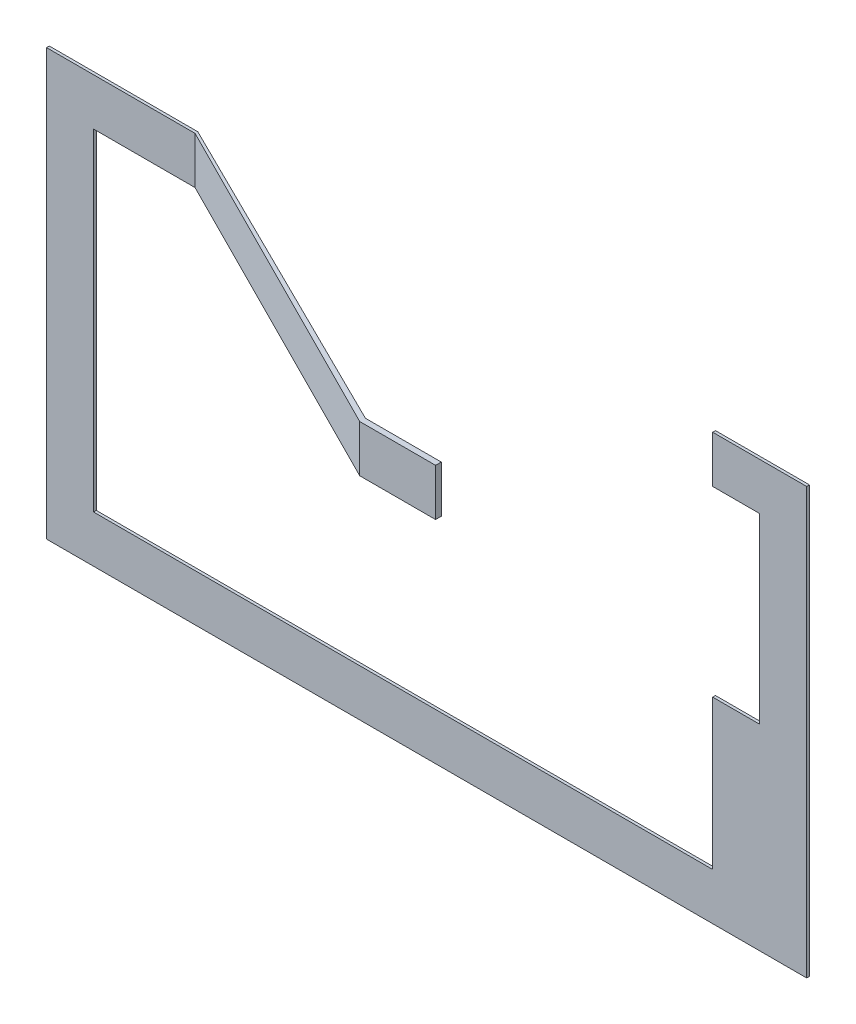
ISO-10303-21;
HEADER;
FILE_DESCRIPTION(('STEP AP214'),'2;1');
FILE_NAME('part.step','',(''),(''),'','','');
FILE_SCHEMA(('AUTOMOTIVE_DESIGN { 1 0 10303 214 1 1 1 1 }'));
ENDSEC;
DATA;
#1=APPLICATION_CONTEXT('core data for automotive mechanical design processes');
#2=APPLICATION_PROTOCOL_DEFINITION('international standard','automotive_design',2000,#1);
#3=PRODUCT_CONTEXT('',#1,'mechanical');
#4=PRODUCT('Part','Part','',(#3));
#5=PRODUCT_RELATED_PRODUCT_CATEGORY('part','',(#4));
#6=PRODUCT_DEFINITION_FORMATION('','',#4);
#7=PRODUCT_DEFINITION_CONTEXT('part definition',#1,'design');
#8=PRODUCT_DEFINITION('design','',#6,#7);
#9=PRODUCT_DEFINITION_SHAPE('','',#8);
#10=(LENGTH_UNIT() NAMED_UNIT(*) SI_UNIT(.MILLI.,.METRE.));
#11=(NAMED_UNIT(*) PLANE_ANGLE_UNIT() SI_UNIT($,.RADIAN.));
#12=(NAMED_UNIT(*) SI_UNIT($,.STERADIAN.) SOLID_ANGLE_UNIT());
#13=UNCERTAINTY_MEASURE_WITH_UNIT(LENGTH_MEASURE(1.E-05),#10,'distance_accuracy_value','');
#14=(GEOMETRIC_REPRESENTATION_CONTEXT(3) GLOBAL_UNCERTAINTY_ASSIGNED_CONTEXT((#13)) GLOBAL_UNIT_ASSIGNED_CONTEXT((#10,
#11,#12)) REPRESENTATION_CONTEXT('',''));
#15=CARTESIAN_POINT('',(0.,0.,0.));
#16=DIRECTION('',(0.,0.,1.));
#17=DIRECTION('',(1.,0.,0.));
#18=AXIS2_PLACEMENT_3D('',#15,#16,#17);
#19=CARTESIAN_POINT('',(-11900.,6700.,-50.0000000000007));
#20=DIRECTION('',(0.,1.,0.));
#21=DIRECTION('',(0.,0.,1.));
#22=AXIS2_PLACEMENT_3D('',#19,#20,#21);
#23=PLANE('',#22);
#24=DIRECTION('',(-1.,0.,0.));
#25=VECTOR('',#24,1.);
#26=CARTESIAN_POINT('',(-11900.,6700.,0.));
#27=LINE('',#26,#25);
#28=CARTESIAN_POINT('',(-9214.46398244719,6700.,0.));
#29=VERTEX_POINT('',#28);
#30=CARTESIAN_POINT('',(-11900.,6700.,0.));
#31=VERTEX_POINT('',#30);
#32=EDGE_CURVE('E170',#29,#31,#27,.T.);
#33=ORIENTED_EDGE('',*,*,#32,.F.);
#34=DIRECTION('',(0.893064348478756,0.,0.449928960477335));
#35=VECTOR('',#34,1.);
#36=CARTESIAN_POINT('',(-9214.46398244719,6700.,0.));
#37=LINE('',#36,#35);
#38=CARTESIAN_POINT('',(-3210.13909684267,6700.,3025.));
#39=VERTEX_POINT('',#38);
#40=EDGE_CURVE('E96',#29,#39,#37,.T.);
#41=ORIENTED_EDGE('',*,*,#40,.T.);
#42=DIRECTION('',(1.,0.,0.));
#43=VECTOR('',#42,1.);
#44=CARTESIAN_POINT('',(-3210.13909684267,6700.,3025.));
#45=LINE('',#44,#43);
#46=CARTESIAN_POINT('',(-1837.69853217535,6700.,3025.));
#47=VERTEX_POINT('',#46);
#48=EDGE_CURVE('E261',#39,#47,#45,.T.);
#49=ORIENTED_EDGE('',*,*,#48,.T.);
#50=DIRECTION('',(0.,0.,-1.));
#51=VECTOR('',#50,1.);
#52=CARTESIAN_POINT('',(-1837.69853217535,6700.,3025.));
#53=LINE('',#52,#51);
#54=CARTESIAN_POINT('',(-1837.69853217535,6700.,2922.06183685759));
#55=VERTEX_POINT('',#54);
#56=EDGE_CURVE('E264',#47,#55,#53,.T.);
#57=ORIENTED_EDGE('',*,*,#56,.T.);
#58=DIRECTION('',(-1.,0.,0.));
#59=VECTOR('',#58,1.);
#60=CARTESIAN_POINT('',(-1837.69853217535,6700.,2922.06183685759));
#61=LINE('',#60,#59);
#62=CARTESIAN_POINT('',(-3210.13909684267,6700.,2922.06183685759));
#63=VERTEX_POINT('',#62);
#64=EDGE_CURVE('E248',#55,#63,#61,.T.);
#65=ORIENTED_EDGE('',*,*,#64,.T.);
#66=DIRECTION('',(-0.896217118847052,0.,-0.443615684895708));
#67=VECTOR('',#66,1.);
#68=CARTESIAN_POINT('',(-3210.13909684267,6700.,2922.06183685759));
#69=LINE('',#68,#67);
#70=CARTESIAN_POINT('',(-9214.46398244719,6700.,-50.0000000000007));
#71=VERTEX_POINT('',#70);
#72=EDGE_CURVE('E244',#63,#71,#69,.T.);
#73=ORIENTED_EDGE('',*,*,#72,.T.);
#74=DIRECTION('',(-1.,0.,0.));
#75=VECTOR('',#74,1.);
#76=CARTESIAN_POINT('',(-11900.,6700.,-50.0000000000007));
#77=LINE('',#76,#75);
#78=CARTESIAN_POINT('',(-11900.,6700.,-50.0000000000007));
#79=VERTEX_POINT('',#78);
#80=EDGE_CURVE('E209',#71,#79,#77,.T.);
#81=ORIENTED_EDGE('',*,*,#80,.T.);
#82=DIRECTION('',(0.,0.,1.));
#83=VECTOR('',#82,1.);
#84=CARTESIAN_POINT('',(-11900.,6700.,-50.0000000000007));
#85=LINE('',#84,#83);
#86=EDGE_CURVE('E33',#79,#31,#85,.T.);
#87=ORIENTED_EDGE('',*,*,#86,.T.);
#88=EDGE_LOOP('',(#33,#41,#49,#57,#65,#73,#81,#87));
#89=FACE_BOUND('',#88,.T.);
#90=ADVANCED_FACE('F30',(#89),#23,.T.);
#91=CARTESIAN_POINT('',(-9214.46398244719,5850.,-50.0000000000007));
#92=DIRECTION('',(0.,-1.,0.));
#93=DIRECTION('',(0.,0.,-1.));
#94=AXIS2_PLACEMENT_3D('',#91,#92,#93);
#95=PLANE('',#94);
#96=DIRECTION('',(1.,0.,0.));
#97=VECTOR('',#96,1.);
#98=CARTESIAN_POINT('',(-9214.46398244719,5850.,0.));
#99=LINE('',#98,#97);
#100=CARTESIAN_POINT('',(-11050.,5850.,0.));
#101=VERTEX_POINT('',#100);
#102=CARTESIAN_POINT('',(-9214.46398244719,5850.,0.));
#103=VERTEX_POINT('',#102);
#104=EDGE_CURVE('E204',#101,#103,#99,.T.);
#105=ORIENTED_EDGE('',*,*,#104,.F.);
#106=DIRECTION('',(0.,0.,1.));
#107=VECTOR('',#106,1.);
#108=CARTESIAN_POINT('',(-11050.,5850.,-50.0000000000007));
#109=LINE('',#108,#107);
#110=CARTESIAN_POINT('',(-11050.,5850.,-50.0000000000007));
#111=VERTEX_POINT('',#110);
#112=EDGE_CURVE('E11',#111,#101,#109,.T.);
#113=ORIENTED_EDGE('',*,*,#112,.F.);
#114=DIRECTION('',(1.,0.,0.));
#115=VECTOR('',#114,1.);
#116=CARTESIAN_POINT('',(-9214.46398244719,5850.,-50.0000000000007));
#117=LINE('',#116,#115);
#118=CARTESIAN_POINT('',(-9214.46398244719,5850.,-50.0000000000007));
#119=VERTEX_POINT('',#118);
#120=EDGE_CURVE('E165',#111,#119,#117,.T.);
#121=ORIENTED_EDGE('',*,*,#120,.T.);
#122=DIRECTION('',(-0.896217118847052,0.,-0.443615684895708));
#123=VECTOR('',#122,1.);
#124=CARTESIAN_POINT('',(-3210.13909684267,5849.99999999999,2922.06183685759));
#125=LINE('',#124,#123);
#126=CARTESIAN_POINT('',(-3210.13909684267,5849.99999999999,2922.06183685759));
#127=VERTEX_POINT('',#126);
#128=EDGE_CURVE('E256',#127,#119,#125,.T.);
#129=ORIENTED_EDGE('',*,*,#128,.F.);
#130=DIRECTION('',(-1.,0.,0.));
#131=VECTOR('',#130,1.);
#132=CARTESIAN_POINT('',(-1837.69853217535,5850.,2922.06183685759));
#133=LINE('',#132,#131);
#134=CARTESIAN_POINT('',(-1837.69853217535,5850.,2922.06183685759));
#135=VERTEX_POINT('',#134);
#136=EDGE_CURVE('E253',#135,#127,#133,.T.);
#137=ORIENTED_EDGE('',*,*,#136,.F.);
#138=DIRECTION('',(0.,0.,-1.));
#139=VECTOR('',#138,1.);
#140=CARTESIAN_POINT('',(-1837.69853217535,5850.,3025.));
#141=LINE('',#140,#139);
#142=CARTESIAN_POINT('',(-1837.69853217535,5850.,3025.));
#143=VERTEX_POINT('',#142);
#144=EDGE_CURVE('E246',#143,#135,#141,.T.);
#145=ORIENTED_EDGE('',*,*,#144,.F.);
#146=DIRECTION('',(1.,0.,0.));
#147=VECTOR('',#146,1.);
#148=CARTESIAN_POINT('',(-3210.13909684267,5850.,3025.));
#149=LINE('',#148,#147);
#150=CARTESIAN_POINT('',(-3210.13909684267,5850.,3025.));
#151=VERTEX_POINT('',#150);
#152=EDGE_CURVE('E243',#151,#143,#149,.T.);
#153=ORIENTED_EDGE('',*,*,#152,.F.);
#154=DIRECTION('',(0.893064348478756,0.,0.449928960477335));
#155=VECTOR('',#154,1.);
#156=CARTESIAN_POINT('',(-9214.46398244719,5850.,0.));
#157=LINE('',#156,#155);
#158=EDGE_CURVE('E237',#103,#151,#157,.T.);
#159=ORIENTED_EDGE('',*,*,#158,.F.);
#160=EDGE_LOOP('',(#105,#113,#121,#129,#137,#145,#153,#159));
#161=FACE_BOUND('',#160,.T.);
#162=ADVANCED_FACE('F240',(#161),#95,.T.);
#163=CARTESIAN_POINT('',(-11050.,5850.,-50.0000000000007));
#164=DIRECTION('',(1.,0.,0.));
#165=DIRECTION('',(0.,0.,-1.));
#166=AXIS2_PLACEMENT_3D('',#163,#164,#165);
#167=PLANE('',#166);
#168=DIRECTION('',(0.,1.,0.));
#169=VECTOR('',#168,1.);
#170=CARTESIAN_POINT('',(-11050.,5850.,0.));
#171=LINE('',#170,#169);
#172=CARTESIAN_POINT('',(-11050.,-149.999999999999,0.));
#173=VERTEX_POINT('',#172);
#174=EDGE_CURVE('E201',#173,#101,#171,.T.);
#175=ORIENTED_EDGE('',*,*,#174,.F.);
#176=DIRECTION('',(0.,0.,1.));
#177=VECTOR('',#176,1.);
#178=CARTESIAN_POINT('',(-11050.,-149.999999999999,-50.0000000000007));
#179=LINE('',#178,#177);
#180=CARTESIAN_POINT('',(-11050.,-149.999999999999,-50.0000000000007));
#181=VERTEX_POINT('',#180);
#182=EDGE_CURVE('E39',#181,#173,#179,.T.);
#183=ORIENTED_EDGE('',*,*,#182,.F.);
#184=DIRECTION('',(0.,1.,0.));
#185=VECTOR('',#184,1.);
#186=CARTESIAN_POINT('',(-11050.,5850.,-50.0000000000007));
#187=LINE('',#186,#185);
#188=EDGE_CURVE('E155',#181,#111,#187,.T.);
#189=ORIENTED_EDGE('',*,*,#188,.T.);
#190=ORIENTED_EDGE('',*,*,#112,.T.);
#191=EDGE_LOOP('',(#175,#183,#189,#190));
#192=FACE_BOUND('',#191,.T.);
#193=ADVANCED_FACE('F334',(#192),#167,.T.);
#194=CARTESIAN_POINT('',(-11050.,-149.999999999999,-50.0000000000007));
#195=DIRECTION('',(0.,1.,0.));
#196=DIRECTION('',(-1.,0.,0.));
#197=AXIS2_PLACEMENT_3D('',#194,#195,#196);
#198=PLANE('',#197);
#199=DIRECTION('',(-1.,0.,0.));
#200=VECTOR('',#199,1.);
#201=CARTESIAN_POINT('',(-11050.,-149.999999999999,0.));
#202=LINE('',#201,#200);
#203=CARTESIAN_POINT('',(149.999999999999,-150.000000000002,0.));
#204=VERTEX_POINT('',#203);
#205=EDGE_CURVE('E140',#204,#173,#202,.T.);
#206=ORIENTED_EDGE('',*,*,#205,.F.);
#207=DIRECTION('',(0.,0.,1.));
#208=VECTOR('',#207,1.);
#209=CARTESIAN_POINT('',(149.999999999999,-149.999999999999,-50.0000000000007));
#210=LINE('',#209,#208);
#211=CARTESIAN_POINT('',(149.999999999999,-149.999999999999,-50.0000000000007));
#212=VERTEX_POINT('',#211);
#213=EDGE_CURVE('E135',#212,#204,#210,.T.);
#214=ORIENTED_EDGE('',*,*,#213,.F.);
#215=DIRECTION('',(-1.,0.,0.));
#216=VECTOR('',#215,1.);
#217=CARTESIAN_POINT('',(-11050.,-149.999999999999,-50.0000000000007));
#218=LINE('',#217,#216);
#219=EDGE_CURVE('E138',#212,#181,#218,.T.);
#220=ORIENTED_EDGE('',*,*,#219,.T.);
#221=ORIENTED_EDGE('',*,*,#182,.T.);
#222=EDGE_LOOP('',(#206,#214,#220,#221));
#223=FACE_BOUND('',#222,.T.);
#224=ADVANCED_FACE('F137',(#223),#198,.T.);
#225=CARTESIAN_POINT('',(149.999999999999,-149.999999999999,-50.0000000000007));
#226=DIRECTION('',(-1.,0.,0.));
#227=DIRECTION('',(0.,0.,1.));
#228=AXIS2_PLACEMENT_3D('',#225,#226,#227);
#229=PLANE('',#228);
#230=DIRECTION('',(0.,-1.,0.));
#231=VECTOR('',#230,1.);
#232=CARTESIAN_POINT('',(149.999999999999,-150.000000000002,0.));
#233=LINE('',#232,#231);
#234=CARTESIAN_POINT('',(149.999999999999,2550.,0.));
#235=VERTEX_POINT('',#234);
#236=EDGE_CURVE('E198',#235,#204,#233,.T.);
#237=ORIENTED_EDGE('',*,*,#236,.F.);
#238=DIRECTION('',(0.,0.,1.));
#239=VECTOR('',#238,1.);
#240=CARTESIAN_POINT('',(149.999999999999,2550.,-50.0000000000007));
#241=LINE('',#240,#239);
#242=CARTESIAN_POINT('',(149.999999999999,2550.,-50.0000000000007));
#243=VERTEX_POINT('',#242);
#244=EDGE_CURVE('E145',#243,#235,#241,.T.);
#245=ORIENTED_EDGE('',*,*,#244,.F.);
#246=DIRECTION('',(0.,-1.,0.));
#247=VECTOR('',#246,1.);
#248=CARTESIAN_POINT('',(149.999999999999,-149.999999999999,-50.0000000000007));
#249=LINE('',#248,#247);
#250=EDGE_CURVE('E153',#243,#212,#249,.T.);
#251=ORIENTED_EDGE('',*,*,#250,.T.);
#252=ORIENTED_EDGE('',*,*,#213,.T.);
#253=EDGE_LOOP('',(#237,#245,#251,#252));
#254=FACE_BOUND('',#253,.T.);
#255=ADVANCED_FACE('F157',(#254),#229,.T.);
#256=CARTESIAN_POINT('',(149.999999999999,2550.,-50.0000000000007));
#257=DIRECTION('',(0.,1.,0.));
#258=DIRECTION('',(0.,0.,1.));
#259=AXIS2_PLACEMENT_3D('',#256,#257,#258);
#260=PLANE('',#259);
#261=DIRECTION('',(-1.,0.,0.));
#262=VECTOR('',#261,1.);
#263=CARTESIAN_POINT('',(149.999999999999,2550.,0.));
#264=LINE('',#263,#262);
#265=CARTESIAN_POINT('',(1000.,2550.,0.));
#266=VERTEX_POINT('',#265);
#267=EDGE_CURVE('E195',#266,#235,#264,.T.);
#268=ORIENTED_EDGE('',*,*,#267,.F.);
#269=DIRECTION('',(0.,0.,1.));
#270=VECTOR('',#269,1.);
#271=CARTESIAN_POINT('',(1000.,2550.,-50.0000000000007));
#272=LINE('',#271,#270);
#273=CARTESIAN_POINT('',(1000.,2550.,-50.0000000000007));
#274=VERTEX_POINT('',#273);
#275=EDGE_CURVE('E213',#274,#266,#272,.T.);
#276=ORIENTED_EDGE('',*,*,#275,.F.);
#277=DIRECTION('',(-1.,0.,0.));
#278=VECTOR('',#277,1.);
#279=CARTESIAN_POINT('',(149.999999999999,2550.,-50.0000000000007));
#280=LINE('',#279,#278);
#281=EDGE_CURVE('E158',#274,#243,#280,.T.);
#282=ORIENTED_EDGE('',*,*,#281,.T.);
#283=ORIENTED_EDGE('',*,*,#244,.T.);
#284=EDGE_LOOP('',(#268,#276,#282,#283));
#285=FACE_BOUND('',#284,.T.);
#286=ADVANCED_FACE('F321',(#285),#260,.T.);
#287=CARTESIAN_POINT('',(1000.,2550.,-50.0000000000007));
#288=DIRECTION('',(-1.,0.,0.));
#289=DIRECTION('',(0.,0.,1.));
#290=AXIS2_PLACEMENT_3D('',#287,#288,#289);
#291=PLANE('',#290);
#292=DIRECTION('',(0.,-1.,0.));
#293=VECTOR('',#292,1.);
#294=CARTESIAN_POINT('',(1000.,2550.,0.));
#295=LINE('',#294,#293);
#296=CARTESIAN_POINT('',(1000.,5850.,0.));
#297=VERTEX_POINT('',#296);
#298=EDGE_CURVE('E192',#297,#266,#295,.T.);
#299=ORIENTED_EDGE('',*,*,#298,.F.);
#300=DIRECTION('',(0.,0.,1.));
#301=VECTOR('',#300,1.);
#302=CARTESIAN_POINT('',(1000.,5850.,-50.0000000000007));
#303=LINE('',#302,#301);
#304=CARTESIAN_POINT('',(1000.,5850.,-50.0000000000007));
#305=VERTEX_POINT('',#304);
#306=EDGE_CURVE('E215',#305,#297,#303,.T.);
#307=ORIENTED_EDGE('',*,*,#306,.F.);
#308=DIRECTION('',(0.,-1.,0.));
#309=VECTOR('',#308,1.);
#310=CARTESIAN_POINT('',(1000.,2550.,-50.0000000000007));
#311=LINE('',#310,#309);
#312=EDGE_CURVE('E160',#305,#274,#311,.T.);
#313=ORIENTED_EDGE('',*,*,#312,.T.);
#314=ORIENTED_EDGE('',*,*,#275,.T.);
#315=EDGE_LOOP('',(#299,#307,#313,#314));
#316=FACE_BOUND('',#315,.T.);
#317=ADVANCED_FACE('F299',(#316),#291,.T.);
#318=CARTESIAN_POINT('',(1000.,5850.,-50.0000000000007));
#319=DIRECTION('',(0.,-1.,0.));
#320=DIRECTION('',(1.,0.,0.));
#321=AXIS2_PLACEMENT_3D('',#318,#319,#320);
#322=PLANE('',#321);
#323=DIRECTION('',(1.,0.,0.));
#324=VECTOR('',#323,1.);
#325=CARTESIAN_POINT('',(1000.,5850.,0.));
#326=LINE('',#325,#324);
#327=CARTESIAN_POINT('',(150.000000000002,5850.,0.));
#328=VERTEX_POINT('',#327);
#329=EDGE_CURVE('E189',#328,#297,#326,.T.);
#330=ORIENTED_EDGE('',*,*,#329,.F.);
#331=DIRECTION('',(0.,0.,1.));
#332=VECTOR('',#331,1.);
#333=CARTESIAN_POINT('',(150.000000000002,5850.,-50.0000000000007));
#334=LINE('',#333,#332);
#335=CARTESIAN_POINT('',(150.000000000002,5850.,-50.0000000000007));
#336=VERTEX_POINT('',#335);
#337=EDGE_CURVE('E217',#336,#328,#334,.T.);
#338=ORIENTED_EDGE('',*,*,#337,.F.);
#339=DIRECTION('',(1.,0.,0.));
#340=VECTOR('',#339,1.);
#341=CARTESIAN_POINT('',(1000.,5850.,-50.0000000000007));
#342=LINE('',#341,#340);
#343=EDGE_CURVE('E293',#336,#305,#342,.T.);
#344=ORIENTED_EDGE('',*,*,#343,.T.);
#345=ORIENTED_EDGE('',*,*,#306,.T.);
#346=EDGE_LOOP('',(#330,#338,#344,#345));
#347=FACE_BOUND('',#346,.T.);
#348=ADVANCED_FACE('F305',(#347),#322,.T.);
#349=CARTESIAN_POINT('',(150.000000000002,5850.,-50.0000000000007));
#350=DIRECTION('',(-1.,0.,0.));
#351=DIRECTION('',(0.,-1.,0.));
#352=AXIS2_PLACEMENT_3D('',#349,#350,#351);
#353=PLANE('',#352);
#354=DIRECTION('',(0.,-1.,0.));
#355=VECTOR('',#354,1.);
#356=CARTESIAN_POINT('',(150.000000000002,5850.,0.));
#357=LINE('',#356,#355);
#358=CARTESIAN_POINT('',(150.000000000002,6700.,0.));
#359=VERTEX_POINT('',#358);
#360=EDGE_CURVE('E186',#359,#328,#357,.T.);
#361=ORIENTED_EDGE('',*,*,#360,.F.);
#362=DIRECTION('',(0.,0.,1.));
#363=VECTOR('',#362,1.);
#364=CARTESIAN_POINT('',(150.000000000002,6700.,-50.0000000000007));
#365=LINE('',#364,#363);
#366=CARTESIAN_POINT('',(150.000000000002,6700.,-50.0000000000007));
#367=VERTEX_POINT('',#366);
#368=EDGE_CURVE('E219',#367,#359,#365,.T.);
#369=ORIENTED_EDGE('',*,*,#368,.F.);
#370=DIRECTION('',(0.,-1.,0.));
#371=VECTOR('',#370,1.);
#372=CARTESIAN_POINT('',(150.000000000002,5850.,-50.0000000000007));
#373=LINE('',#372,#371);
#374=EDGE_CURVE('E290',#367,#336,#373,.T.);
#375=ORIENTED_EDGE('',*,*,#374,.T.);
#376=ORIENTED_EDGE('',*,*,#337,.T.);
#377=EDGE_LOOP('',(#361,#369,#375,#376));
#378=FACE_BOUND('',#377,.T.);
#379=ADVANCED_FACE('F308',(#378),#353,.T.);
#380=CARTESIAN_POINT('',(150.000000000002,6700.,-50.0000000000007));
#381=DIRECTION('',(0.,1.,0.));
#382=DIRECTION('',(-1.,0.,0.));
#383=AXIS2_PLACEMENT_3D('',#380,#381,#382);
#384=PLANE('',#383);
#385=DIRECTION('',(-1.,0.,0.));
#386=VECTOR('',#385,1.);
#387=CARTESIAN_POINT('',(150.000000000002,6700.,0.));
#388=LINE('',#387,#386);
#389=CARTESIAN_POINT('',(1850.,6700.,0.));
#390=VERTEX_POINT('',#389);
#391=EDGE_CURVE('E183',#390,#359,#388,.T.);
#392=ORIENTED_EDGE('',*,*,#391,.F.);
#393=DIRECTION('',(0.,0.,1.));
#394=VECTOR('',#393,1.);
#395=CARTESIAN_POINT('',(1850.,6700.,-50.0000000000007));
#396=LINE('',#395,#394);
#397=CARTESIAN_POINT('',(1850.,6700.,-50.0000000000007));
#398=VERTEX_POINT('',#397);
#399=EDGE_CURVE('E221',#398,#390,#396,.T.);
#400=ORIENTED_EDGE('',*,*,#399,.F.);
#401=DIRECTION('',(-1.,0.,0.));
#402=VECTOR('',#401,1.);
#403=CARTESIAN_POINT('',(150.000000000002,6700.,-50.0000000000007));
#404=LINE('',#403,#402);
#405=EDGE_CURVE('E287',#398,#367,#404,.T.);
#406=ORIENTED_EDGE('',*,*,#405,.T.);
#407=ORIENTED_EDGE('',*,*,#368,.T.);
#408=EDGE_LOOP('',(#392,#400,#406,#407));
#409=FACE_BOUND('',#408,.T.);
#410=ADVANCED_FACE('F313',(#409),#384,.T.);
#411=CARTESIAN_POINT('',(1850.,6700.,-50.0000000000007));
#412=DIRECTION('',(1.,0.,0.));
#413=DIRECTION('',(0.,1.,0.));
#414=AXIS2_PLACEMENT_3D('',#411,#412,#413);
#415=PLANE('',#414);
#416=DIRECTION('',(0.,1.,0.));
#417=VECTOR('',#416,1.);
#418=CARTESIAN_POINT('',(1850.,6700.,0.));
#419=LINE('',#418,#417);
#420=CARTESIAN_POINT('',(1850.,-999.999999999996,0.));
#421=VERTEX_POINT('',#420);
#422=EDGE_CURVE('E180',#421,#390,#419,.T.);
#423=ORIENTED_EDGE('',*,*,#422,.F.);
#424=DIRECTION('',(0.,0.,1.));
#425=VECTOR('',#424,1.);
#426=CARTESIAN_POINT('',(1850.,-999.999999999996,-50.0000000000007));
#427=LINE('',#426,#425);
#428=CARTESIAN_POINT('',(1850.,-999.999999999996,-50.0000000000007));
#429=VERTEX_POINT('',#428);
#430=EDGE_CURVE('E223',#429,#421,#427,.T.);
#431=ORIENTED_EDGE('',*,*,#430,.F.);
#432=DIRECTION('',(0.,1.,0.));
#433=VECTOR('',#432,1.);
#434=CARTESIAN_POINT('',(1850.,6700.,-50.0000000000007));
#435=LINE('',#434,#433);
#436=EDGE_CURVE('E284',#429,#398,#435,.T.);
#437=ORIENTED_EDGE('',*,*,#436,.T.);
#438=ORIENTED_EDGE('',*,*,#399,.T.);
#439=EDGE_LOOP('',(#423,#431,#437,#438));
#440=FACE_BOUND('',#439,.T.);
#441=ADVANCED_FACE('F316',(#440),#415,.T.);
#442=CARTESIAN_POINT('',(1850.,-999.999999999996,-50.0000000000007));
#443=DIRECTION('',(0.,-1.,0.));
#444=DIRECTION('',(1.,0.,0.));
#445=AXIS2_PLACEMENT_3D('',#442,#443,#444);
#446=PLANE('',#445);
#447=DIRECTION('',(1.,0.,0.));
#448=VECTOR('',#447,1.);
#449=CARTESIAN_POINT('',(1850.,-999.999999999996,0.));
#450=LINE('',#449,#448);
#451=CARTESIAN_POINT('',(-11900.,-999.999999999996,0.));
#452=VERTEX_POINT('',#451);
#453=EDGE_CURVE('E177',#452,#421,#450,.T.);
#454=ORIENTED_EDGE('',*,*,#453,.F.);
#455=DIRECTION('',(0.,0.,1.));
#456=VECTOR('',#455,1.);
#457=CARTESIAN_POINT('',(-11900.,-999.999999999996,-50.0000000000007));
#458=LINE('',#457,#456);
#459=CARTESIAN_POINT('',(-11900.,-999.999999999996,-50.0000000000007));
#460=VERTEX_POINT('',#459);
#461=EDGE_CURVE('E224',#460,#452,#458,.T.);
#462=ORIENTED_EDGE('',*,*,#461,.F.);
#463=DIRECTION('',(1.,0.,0.));
#464=VECTOR('',#463,1.);
#465=CARTESIAN_POINT('',(1850.,-999.999999999996,-50.0000000000007));
#466=LINE('',#465,#464);
#467=EDGE_CURVE('E281',#460,#429,#466,.T.);
#468=ORIENTED_EDGE('',*,*,#467,.T.);
#469=ORIENTED_EDGE('',*,*,#430,.T.);
#470=EDGE_LOOP('',(#454,#462,#468,#469));
#471=FACE_BOUND('',#470,.T.);
#472=ADVANCED_FACE('F319',(#471),#446,.T.);
#473=CARTESIAN_POINT('',(-11900.,-999.999999999996,-50.0000000000007));
#474=DIRECTION('',(-1.,0.,0.));
#475=DIRECTION('',(0.,0.,1.));
#476=AXIS2_PLACEMENT_3D('',#473,#474,#475);
#477=PLANE('',#476);
#478=DIRECTION('',(0.,-1.,0.));
#479=VECTOR('',#478,1.);
#480=CARTESIAN_POINT('',(-11900.,-999.999999999996,0.));
#481=LINE('',#480,#479);
#482=EDGE_CURVE('E173',#31,#452,#481,.T.);
#483=ORIENTED_EDGE('',*,*,#482,.F.);
#484=ORIENTED_EDGE('',*,*,#86,.F.);
#485=DIRECTION('',(0.,-1.,0.));
#486=VECTOR('',#485,1.);
#487=CARTESIAN_POINT('',(-11900.,-999.999999999996,-50.0000000000007));
#488=LINE('',#487,#486);
#489=EDGE_CURVE('E279',#79,#460,#488,.T.);
#490=ORIENTED_EDGE('',*,*,#489,.T.);
#491=ORIENTED_EDGE('',*,*,#461,.T.);
#492=EDGE_LOOP('',(#483,#484,#490,#491));
#493=FACE_BOUND('',#492,.T.);
#494=ADVANCED_FACE('F229',(#493),#477,.T.);
#495=CARTESIAN_POINT('',(-9214.46398244719,6700.,-50.0000000000007));
#496=DIRECTION('',(0.,0.,-1.));
#497=DIRECTION('',(-1.,0.,0.));
#498=AXIS2_PLACEMENT_3D('',#495,#496,#497);
#499=PLANE('',#498);
#500=ORIENTED_EDGE('',*,*,#80,.F.);
#501=DIRECTION('',(0.,1.,0.));
#502=VECTOR('',#501,1.);
#503=CARTESIAN_POINT('',(-9214.46398244719,6700.,-50.0000000000007));
#504=LINE('',#503,#502);
#505=EDGE_CURVE('E167',#119,#71,#504,.T.);
#506=ORIENTED_EDGE('',*,*,#505,.F.);
#507=ORIENTED_EDGE('',*,*,#120,.F.);
#508=ORIENTED_EDGE('',*,*,#188,.F.);
#509=ORIENTED_EDGE('',*,*,#219,.F.);
#510=ORIENTED_EDGE('',*,*,#250,.F.);
#511=ORIENTED_EDGE('',*,*,#281,.F.);
#512=ORIENTED_EDGE('',*,*,#312,.F.);
#513=ORIENTED_EDGE('',*,*,#343,.F.);
#514=ORIENTED_EDGE('',*,*,#374,.F.);
#515=ORIENTED_EDGE('',*,*,#405,.F.);
#516=ORIENTED_EDGE('',*,*,#436,.F.);
#517=ORIENTED_EDGE('',*,*,#467,.F.);
#518=ORIENTED_EDGE('',*,*,#489,.F.);
#519=EDGE_LOOP('',(#500,#506,#507,#508,#509,#510,#511,#512,#513,#514,#515,#516,#517,#518));
#520=FACE_BOUND('',#519,.T.);
#521=ADVANCED_FACE('F151',(#520),#499,.T.);
#522=CARTESIAN_POINT('',(-9214.46398244719,6700.,0.));
#523=DIRECTION('',(0.,0.,-1.));
#524=DIRECTION('',(-1.,0.,0.));
#525=AXIS2_PLACEMENT_3D('',#522,#523,#524);
#526=PLANE('',#525);
#527=ORIENTED_EDGE('',*,*,#32,.T.);
#528=ORIENTED_EDGE('',*,*,#482,.T.);
#529=ORIENTED_EDGE('',*,*,#453,.T.);
#530=ORIENTED_EDGE('',*,*,#422,.T.);
#531=ORIENTED_EDGE('',*,*,#391,.T.);
#532=ORIENTED_EDGE('',*,*,#360,.T.);
#533=ORIENTED_EDGE('',*,*,#329,.T.);
#534=ORIENTED_EDGE('',*,*,#298,.T.);
#535=ORIENTED_EDGE('',*,*,#267,.T.);
#536=ORIENTED_EDGE('',*,*,#236,.T.);
#537=ORIENTED_EDGE('',*,*,#205,.T.);
#538=ORIENTED_EDGE('',*,*,#174,.T.);
#539=ORIENTED_EDGE('',*,*,#104,.T.);
#540=DIRECTION('',(0.,1.,0.));
#541=VECTOR('',#540,1.);
#542=CARTESIAN_POINT('',(-9214.46398244719,6700.,0.));
#543=LINE('',#542,#541);
#544=EDGE_CURVE('E207',#103,#29,#543,.T.);
#545=ORIENTED_EDGE('',*,*,#544,.T.);
#546=EDGE_LOOP('',(#527,#528,#529,#530,#531,#532,#533,#534,#535,#536,#537,#538,#539,#545));
#547=FACE_BOUND('',#546,.T.);
#548=ADVANCED_FACE('F231',(#547),#526,.F.);
#549=CARTESIAN_POINT('',(-3210.13909684267,5849.99999999999,2922.06183685759));
#550=DIRECTION('',(0.443615684895708,0.,-0.896217118847053));
#551=DIRECTION('',(-0.896217118847053,0.,-0.443615684895708));
#552=AXIS2_PLACEMENT_3D('',#549,#550,#551);
#553=PLANE('',#552);
#554=ORIENTED_EDGE('',*,*,#72,.F.);
#555=DIRECTION('',(0.,1.,0.));
#556=VECTOR('',#555,1.);
#557=CARTESIAN_POINT('',(-3210.13909684267,5849.99999999999,2922.06183685759));
#558=LINE('',#557,#556);
#559=EDGE_CURVE('E174',#127,#63,#558,.T.);
#560=ORIENTED_EDGE('',*,*,#559,.F.);
#561=ORIENTED_EDGE('',*,*,#128,.T.);
#562=ORIENTED_EDGE('',*,*,#505,.T.);
#563=EDGE_LOOP('',(#554,#560,#561,#562));
#564=FACE_BOUND('',#563,.T.);
#565=ADVANCED_FACE('F425',(#564),#553,.T.);
#566=CARTESIAN_POINT('',(-1837.69853217535,5850.,2922.06183685759));
#567=DIRECTION('',(0.,0.,-1.));
#568=DIRECTION('',(-1.,0.,0.));
#569=AXIS2_PLACEMENT_3D('',#566,#567,#568);
#570=PLANE('',#569);
#571=ORIENTED_EDGE('',*,*,#64,.F.);
#572=DIRECTION('',(0.,1.,0.));
#573=VECTOR('',#572,1.);
#574=CARTESIAN_POINT('',(-1837.69853217535,5850.,2922.06183685759));
#575=LINE('',#574,#573);
#576=EDGE_CURVE('E271',#135,#55,#575,.T.);
#577=ORIENTED_EDGE('',*,*,#576,.F.);
#578=ORIENTED_EDGE('',*,*,#136,.T.);
#579=ORIENTED_EDGE('',*,*,#559,.T.);
#580=EDGE_LOOP('',(#571,#577,#578,#579));
#581=FACE_BOUND('',#580,.T.);
#582=ADVANCED_FACE('F434',(#581),#570,.T.);
#583=CARTESIAN_POINT('',(-1837.69853217535,5850.,3025.));
#584=DIRECTION('',(1.,0.,0.));
#585=DIRECTION('',(0.,0.,-1.));
#586=AXIS2_PLACEMENT_3D('',#583,#584,#585);
#587=PLANE('',#586);
#588=ORIENTED_EDGE('',*,*,#56,.F.);
#589=DIRECTION('',(0.,1.,0.));
#590=VECTOR('',#589,1.);
#591=CARTESIAN_POINT('',(-1837.69853217535,5850.,3025.));
#592=LINE('',#591,#590);
#593=EDGE_CURVE('E274',#143,#47,#592,.T.);
#594=ORIENTED_EDGE('',*,*,#593,.F.);
#595=ORIENTED_EDGE('',*,*,#144,.T.);
#596=ORIENTED_EDGE('',*,*,#576,.T.);
#597=EDGE_LOOP('',(#588,#594,#595,#596));
#598=FACE_BOUND('',#597,.T.);
#599=ADVANCED_FACE('F445',(#598),#587,.T.);
#600=CARTESIAN_POINT('',(-3210.13909684267,5850.,3025.));
#601=DIRECTION('',(0.,0.,1.));
#602=DIRECTION('',(1.,0.,0.));
#603=AXIS2_PLACEMENT_3D('',#600,#601,#602);
#604=PLANE('',#603);
#605=ORIENTED_EDGE('',*,*,#48,.F.);
#606=DIRECTION('',(0.,1.,0.));
#607=VECTOR('',#606,1.);
#608=CARTESIAN_POINT('',(-3210.13909684267,5850.,3025.));
#609=LINE('',#608,#607);
#610=EDGE_CURVE('E259',#151,#39,#609,.T.);
#611=ORIENTED_EDGE('',*,*,#610,.F.);
#612=ORIENTED_EDGE('',*,*,#152,.T.);
#613=ORIENTED_EDGE('',*,*,#593,.T.);
#614=EDGE_LOOP('',(#605,#611,#612,#613));
#615=FACE_BOUND('',#614,.T.);
#616=ADVANCED_FACE('F455',(#615),#604,.T.);
#617=CARTESIAN_POINT('',(-9214.46398244719,5850.,0.));
#618=DIRECTION('',(-0.449928960477335,0.,0.893064348478756));
#619=DIRECTION('',(0.893064348478756,0.,0.449928960477335));
#620=AXIS2_PLACEMENT_3D('',#617,#618,#619);
#621=PLANE('',#620);
#622=ORIENTED_EDGE('',*,*,#40,.F.);
#623=ORIENTED_EDGE('',*,*,#544,.F.);
#624=ORIENTED_EDGE('',*,*,#158,.T.);
#625=ORIENTED_EDGE('',*,*,#610,.T.);
#626=EDGE_LOOP('',(#622,#623,#624,#625));
#627=FACE_BOUND('',#626,.T.);
#628=ADVANCED_FACE('F235',(#627),#621,.T.);
#629=CLOSED_SHELL('',(#90,#162,#193,#224,#255,#286,#317,#348,#379,#410,#441,#472,#494,#521,#548,
#565,#582,#599,#616,#628));
#630=MANIFOLD_SOLID_BREP('B2',#629);
#631=ADVANCED_BREP_SHAPE_REPRESENTATION('',(#18,#630),#14);
#632=SHAPE_DEFINITION_REPRESENTATION(#9,#631);
ENDSEC;
END-ISO-10303-21;
